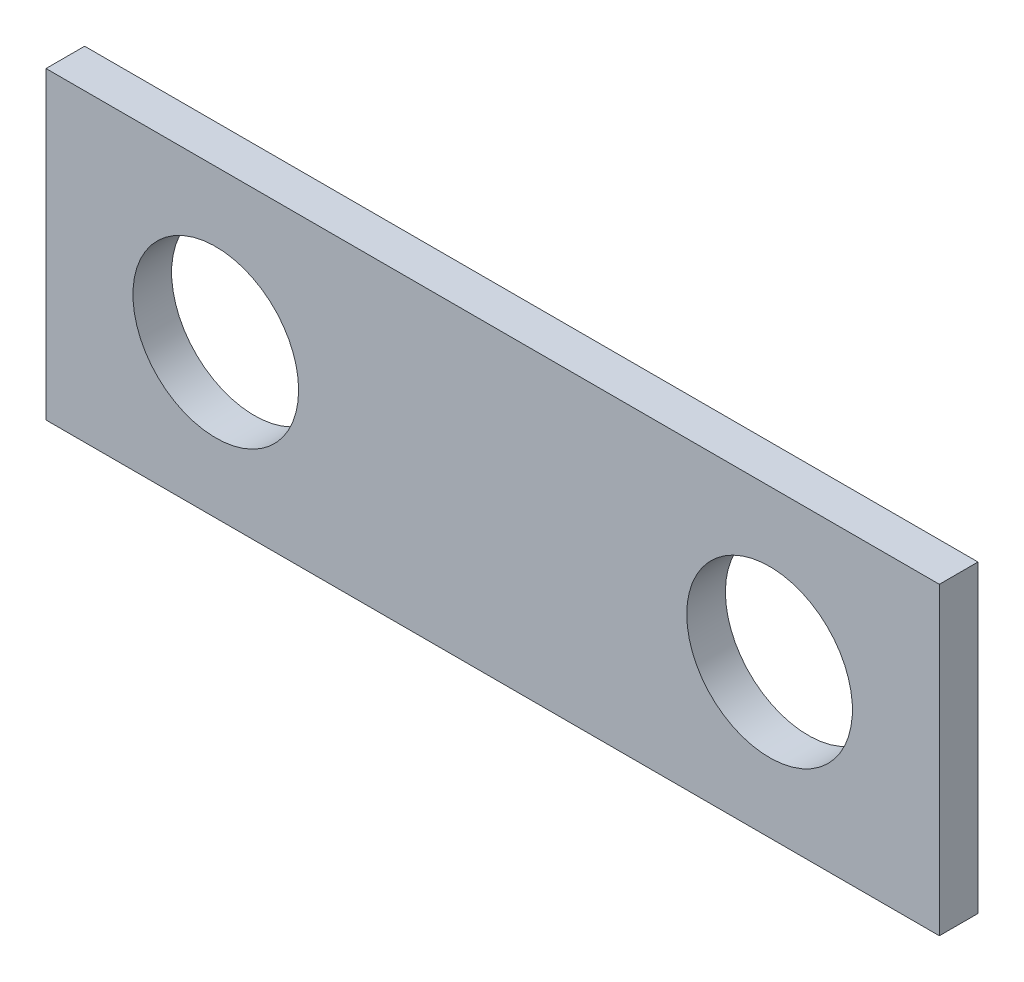
ISO-10303-21;
HEADER;
FILE_DESCRIPTION(('STEP AP214'),'2;1');
FILE_NAME('part.step','',(''),(''),'','','');
FILE_SCHEMA(('AUTOMOTIVE_DESIGN { 1 0 10303 214 1 1 1 1 }'));
ENDSEC;
DATA;
#1=APPLICATION_CONTEXT('core data for automotive mechanical design processes');
#2=APPLICATION_PROTOCOL_DEFINITION('international standard','automotive_design',2000,#1);
#3=PRODUCT_CONTEXT('',#1,'mechanical');
#4=PRODUCT('Part','Part','',(#3));
#5=PRODUCT_RELATED_PRODUCT_CATEGORY('part','',(#4));
#6=PRODUCT_DEFINITION_FORMATION('','',#4);
#7=PRODUCT_DEFINITION_CONTEXT('part definition',#1,'design');
#8=PRODUCT_DEFINITION('design','',#6,#7);
#9=PRODUCT_DEFINITION_SHAPE('','',#8);
#10=(LENGTH_UNIT() NAMED_UNIT(*) SI_UNIT(.MILLI.,.METRE.));
#11=(NAMED_UNIT(*) PLANE_ANGLE_UNIT() SI_UNIT($,.RADIAN.));
#12=(NAMED_UNIT(*) SI_UNIT($,.STERADIAN.) SOLID_ANGLE_UNIT());
#13=UNCERTAINTY_MEASURE_WITH_UNIT(LENGTH_MEASURE(1.E-05),#10,'distance_accuracy_value','');
#14=(GEOMETRIC_REPRESENTATION_CONTEXT(3) GLOBAL_UNCERTAINTY_ASSIGNED_CONTEXT((#13)) GLOBAL_UNIT_ASSIGNED_CONTEXT((#10,
#11,#12)) REPRESENTATION_CONTEXT('',''));
#15=CARTESIAN_POINT('',(0.,0.,0.));
#16=DIRECTION('',(0.,0.,1.));
#17=DIRECTION('',(1.,0.,0.));
#18=AXIS2_PLACEMENT_3D('',#15,#16,#17);
#19=CARTESIAN_POINT('',(0.,0.,0.8382));
#20=DIRECTION('',(1.,0.,0.));
#21=DIRECTION('',(0.,0.,-1.));
#22=AXIS2_PLACEMENT_3D('',#19,#20,#21);
#23=PLANE('',#22);
#24=DIRECTION('',(0.,-1.,0.));
#25=VECTOR('',#24,1.);
#26=CARTESIAN_POINT('',(0.,0.,0.));
#27=LINE('',#26,#25);
#28=CARTESIAN_POINT('',(0.,6.604,0.));
#29=VERTEX_POINT('',#28);
#30=CARTESIAN_POINT('',(0.,0.,0.));
#31=VERTEX_POINT('',#30);
#32=EDGE_CURVE('E96',#29,#31,#27,.T.);
#33=ORIENTED_EDGE('',*,*,#32,.T.);
#34=DIRECTION('',(0.,0.,-1.));
#35=VECTOR('',#34,1.);
#36=CARTESIAN_POINT('',(0.,0.,0.8382));
#37=LINE('',#36,#35);
#38=CARTESIAN_POINT('',(0.,0.,0.8382));
#39=VERTEX_POINT('',#38);
#40=EDGE_CURVE('E11',#39,#31,#37,.T.);
#41=ORIENTED_EDGE('',*,*,#40,.F.);
#42=DIRECTION('',(0.,-1.,0.));
#43=VECTOR('',#42,1.);
#44=CARTESIAN_POINT('',(0.,0.,0.8382));
#45=LINE('',#44,#43);
#46=CARTESIAN_POINT('',(0.,6.604,0.8382));
#47=VERTEX_POINT('',#46);
#48=EDGE_CURVE('E84',#47,#39,#45,.T.);
#49=ORIENTED_EDGE('',*,*,#48,.F.);
#50=DIRECTION('',(0.,0.,-1.));
#51=VECTOR('',#50,1.);
#52=CARTESIAN_POINT('',(0.,6.604,0.8382));
#53=LINE('',#52,#51);
#54=EDGE_CURVE('E92',#47,#29,#53,.T.);
#55=ORIENTED_EDGE('',*,*,#54,.T.);
#56=EDGE_LOOP('',(#33,#41,#49,#55));
#57=FACE_BOUND('',#56,.T.);
#58=ADVANCED_FACE('F33',(#57),#23,.F.);
#59=CARTESIAN_POINT('',(0.,0.,0.8382));
#60=DIRECTION('',(0.,1.,0.));
#61=DIRECTION('',(0.,0.,1.));
#62=AXIS2_PLACEMENT_3D('',#59,#60,#61);
#63=PLANE('',#62);
#64=DIRECTION('',(1.,0.,0.));
#65=VECTOR('',#64,1.);
#66=CARTESIAN_POINT('',(0.,0.,0.));
#67=LINE('',#66,#65);
#68=CARTESIAN_POINT('',(19.3802,0.,0.));
#69=VERTEX_POINT('',#68);
#70=EDGE_CURVE('E88',#31,#69,#67,.T.);
#71=ORIENTED_EDGE('',*,*,#70,.T.);
#72=DIRECTION('',(0.,0.,-1.));
#73=VECTOR('',#72,1.);
#74=CARTESIAN_POINT('',(19.3802,0.,0.8382));
#75=LINE('',#74,#73);
#76=CARTESIAN_POINT('',(19.3802,0.,0.8382));
#77=VERTEX_POINT('',#76);
#78=EDGE_CURVE('E41',#77,#69,#75,.T.);
#79=ORIENTED_EDGE('',*,*,#78,.F.);
#80=DIRECTION('',(1.,0.,0.));
#81=VECTOR('',#80,1.);
#82=CARTESIAN_POINT('',(0.,0.,0.8382));
#83=LINE('',#82,#81);
#84=EDGE_CURVE('E79',#39,#77,#83,.T.);
#85=ORIENTED_EDGE('',*,*,#84,.F.);
#86=ORIENTED_EDGE('',*,*,#40,.T.);
#87=EDGE_LOOP('',(#71,#79,#85,#86));
#88=FACE_BOUND('',#87,.T.);
#89=ADVANCED_FACE('F87',(#88),#63,.F.);
#90=CARTESIAN_POINT('',(19.3802,0.,0.8382));
#91=DIRECTION('',(-1.,0.,0.));
#92=DIRECTION('',(0.,0.,1.));
#93=AXIS2_PLACEMENT_3D('',#90,#91,#92);
#94=PLANE('',#93);
#95=DIRECTION('',(0.,1.,0.));
#96=VECTOR('',#95,1.);
#97=CARTESIAN_POINT('',(19.3802,0.,0.));
#98=LINE('',#97,#96);
#99=CARTESIAN_POINT('',(19.3802,6.604,0.));
#100=VERTEX_POINT('',#99);
#101=EDGE_CURVE('E66',#69,#100,#98,.T.);
#102=ORIENTED_EDGE('',*,*,#101,.T.);
#103=DIRECTION('',(0.,0.,-1.));
#104=VECTOR('',#103,1.);
#105=CARTESIAN_POINT('',(19.3802,6.604,0.8382));
#106=LINE('',#105,#104);
#107=CARTESIAN_POINT('',(19.3802,6.604,0.8382));
#108=VERTEX_POINT('',#107);
#109=EDGE_CURVE('E89',#108,#100,#106,.T.);
#110=ORIENTED_EDGE('',*,*,#109,.F.);
#111=DIRECTION('',(0.,1.,0.));
#112=VECTOR('',#111,1.);
#113=CARTESIAN_POINT('',(19.3802,0.,0.8382));
#114=LINE('',#113,#112);
#115=EDGE_CURVE('E82',#77,#108,#114,.T.);
#116=ORIENTED_EDGE('',*,*,#115,.F.);
#117=ORIENTED_EDGE('',*,*,#78,.T.);
#118=EDGE_LOOP('',(#102,#110,#116,#117));
#119=FACE_BOUND('',#118,.T.);
#120=ADVANCED_FACE('F90',(#119),#94,.F.);
#121=CARTESIAN_POINT('',(0.,6.604,0.8382));
#122=DIRECTION('',(0.,-1.,0.));
#123=DIRECTION('',(0.,0.,-1.));
#124=AXIS2_PLACEMENT_3D('',#121,#122,#123);
#125=PLANE('',#124);
#126=DIRECTION('',(-1.,0.,0.));
#127=VECTOR('',#126,1.);
#128=CARTESIAN_POINT('',(0.,6.604,0.));
#129=LINE('',#128,#127);
#130=EDGE_CURVE('E72',#100,#29,#129,.T.);
#131=ORIENTED_EDGE('',*,*,#130,.T.);
#132=ORIENTED_EDGE('',*,*,#54,.F.);
#133=DIRECTION('',(-1.,0.,0.));
#134=VECTOR('',#133,1.);
#135=CARTESIAN_POINT('',(0.,6.604,0.8382));
#136=LINE('',#135,#134);
#137=EDGE_CURVE('E49',#108,#47,#136,.T.);
#138=ORIENTED_EDGE('',*,*,#137,.F.);
#139=ORIENTED_EDGE('',*,*,#109,.T.);
#140=EDGE_LOOP('',(#131,#132,#138,#139));
#141=FACE_BOUND('',#140,.T.);
#142=ADVANCED_FACE('F104',(#141),#125,.F.);
#143=CARTESIAN_POINT('',(0.,0.,0.8382));
#144=DIRECTION('',(0.,0.,-1.));
#145=DIRECTION('',(-1.,0.,0.));
#146=AXIS2_PLACEMENT_3D('',#143,#144,#145);
#147=PLANE('',#146);
#148=CARTESIAN_POINT('',(15.6972,3.302,0.8382));
#149=DIRECTION('',(0.,0.,1.));
#150=DIRECTION('',(-1.,0.,0.));
#151=AXIS2_PLACEMENT_3D('',#148,#149,#150);
#152=CIRCLE('',#151,1.79705);
#153=CARTESIAN_POINT('',(13.90015,3.302,0.8382));
#154=VERTEX_POINT('',#153);
#155=EDGE_CURVE('E116',#154,#154,#152,.T.);
#156=ORIENTED_EDGE('',*,*,#155,.F.);
#157=EDGE_LOOP('',(#156));
#158=FACE_BOUND('',#157,.T.);
#159=CARTESIAN_POINT('',(3.683,3.302,0.8382));
#160=DIRECTION('',(0.,0.,1.));
#161=DIRECTION('',(1.,0.,0.));
#162=AXIS2_PLACEMENT_3D('',#159,#160,#161);
#163=CIRCLE('',#162,1.79705);
#164=CARTESIAN_POINT('',(5.48005,3.302,0.8382));
#165=VERTEX_POINT('',#164);
#166=EDGE_CURVE('E110',#165,#165,#163,.T.);
#167=ORIENTED_EDGE('',*,*,#166,.F.);
#168=EDGE_LOOP('',(#167));
#169=FACE_BOUND('',#168,.T.);
#170=ORIENTED_EDGE('',*,*,#48,.T.);
#171=ORIENTED_EDGE('',*,*,#84,.T.);
#172=ORIENTED_EDGE('',*,*,#115,.T.);
#173=ORIENTED_EDGE('',*,*,#137,.T.);
#174=EDGE_LOOP('',(#170,#171,#172,#173));
#175=FACE_BOUND('',#174,.T.);
#176=ADVANCED_FACE('F80',(#158,#169,#175),#147,.F.);
#177=CARTESIAN_POINT('',(0.,0.,0.));
#178=DIRECTION('',(0.,0.,-1.));
#179=DIRECTION('',(-1.,0.,0.));
#180=AXIS2_PLACEMENT_3D('',#177,#178,#179);
#181=PLANE('',#180);
#182=CARTESIAN_POINT('',(15.6972,3.302,0.));
#183=DIRECTION('',(0.,0.,1.));
#184=DIRECTION('',(-1.,0.,0.));
#185=AXIS2_PLACEMENT_3D('',#182,#183,#184);
#186=CIRCLE('',#185,1.79705);
#187=CARTESIAN_POINT('',(13.90015,3.302,0.));
#188=VERTEX_POINT('',#187);
#189=EDGE_CURVE('E113',#188,#188,#186,.T.);
#190=ORIENTED_EDGE('',*,*,#189,.T.);
#191=EDGE_LOOP('',(#190));
#192=FACE_BOUND('',#191,.T.);
#193=CARTESIAN_POINT('',(3.683,3.302,0.));
#194=DIRECTION('',(0.,0.,1.));
#195=DIRECTION('',(1.,0.,0.));
#196=AXIS2_PLACEMENT_3D('',#193,#194,#195);
#197=CIRCLE('',#196,1.79705);
#198=CARTESIAN_POINT('',(5.48005,3.302,0.));
#199=VERTEX_POINT('',#198);
#200=EDGE_CURVE('E99',#199,#199,#197,.T.);
#201=ORIENTED_EDGE('',*,*,#200,.T.);
#202=EDGE_LOOP('',(#201));
#203=FACE_BOUND('',#202,.T.);
#204=ORIENTED_EDGE('',*,*,#32,.F.);
#205=ORIENTED_EDGE('',*,*,#130,.F.);
#206=ORIENTED_EDGE('',*,*,#101,.F.);
#207=ORIENTED_EDGE('',*,*,#70,.F.);
#208=EDGE_LOOP('',(#204,#205,#206,#207));
#209=FACE_BOUND('',#208,.T.);
#210=ADVANCED_FACE('F107',(#192,#203,#209),#181,.T.);
#211=CARTESIAN_POINT('',(3.683,3.302,0.));
#212=DIRECTION('',(0.,0.,1.));
#213=DIRECTION('',(1.,0.,0.));
#214=AXIS2_PLACEMENT_3D('',#211,#212,#213);
#215=CYLINDRICAL_SURFACE('',#214,1.79705);
#216=ORIENTED_EDGE('',*,*,#200,.F.);
#217=EDGE_LOOP('',(#216));
#218=FACE_BOUND('',#217,.T.);
#219=ORIENTED_EDGE('',*,*,#166,.T.);
#220=EDGE_LOOP('',(#219));
#221=FACE_BOUND('',#220,.T.);
#222=ADVANCED_FACE('F127',(#218,#221),#215,.F.);
#223=CARTESIAN_POINT('',(15.6972,3.302,0.));
#224=DIRECTION('',(0.,0.,1.));
#225=DIRECTION('',(1.,0.,0.));
#226=AXIS2_PLACEMENT_3D('',#223,#224,#225);
#227=CYLINDRICAL_SURFACE('',#226,1.79705);
#228=ORIENTED_EDGE('',*,*,#189,.F.);
#229=EDGE_LOOP('',(#228));
#230=FACE_BOUND('',#229,.T.);
#231=ORIENTED_EDGE('',*,*,#155,.T.);
#232=EDGE_LOOP('',(#231));
#233=FACE_BOUND('',#232,.T.);
#234=ADVANCED_FACE('F124',(#230,#233),#227,.F.);
#235=CLOSED_SHELL('',(#58,#89,#120,#142,#176,#210,#222,#234));
#236=MANIFOLD_SOLID_BREP('B2',#235);
#237=ADVANCED_BREP_SHAPE_REPRESENTATION('',(#18,#236),#14);
#238=SHAPE_DEFINITION_REPRESENTATION(#9,#237);
ENDSEC;
END-ISO-10303-21;
